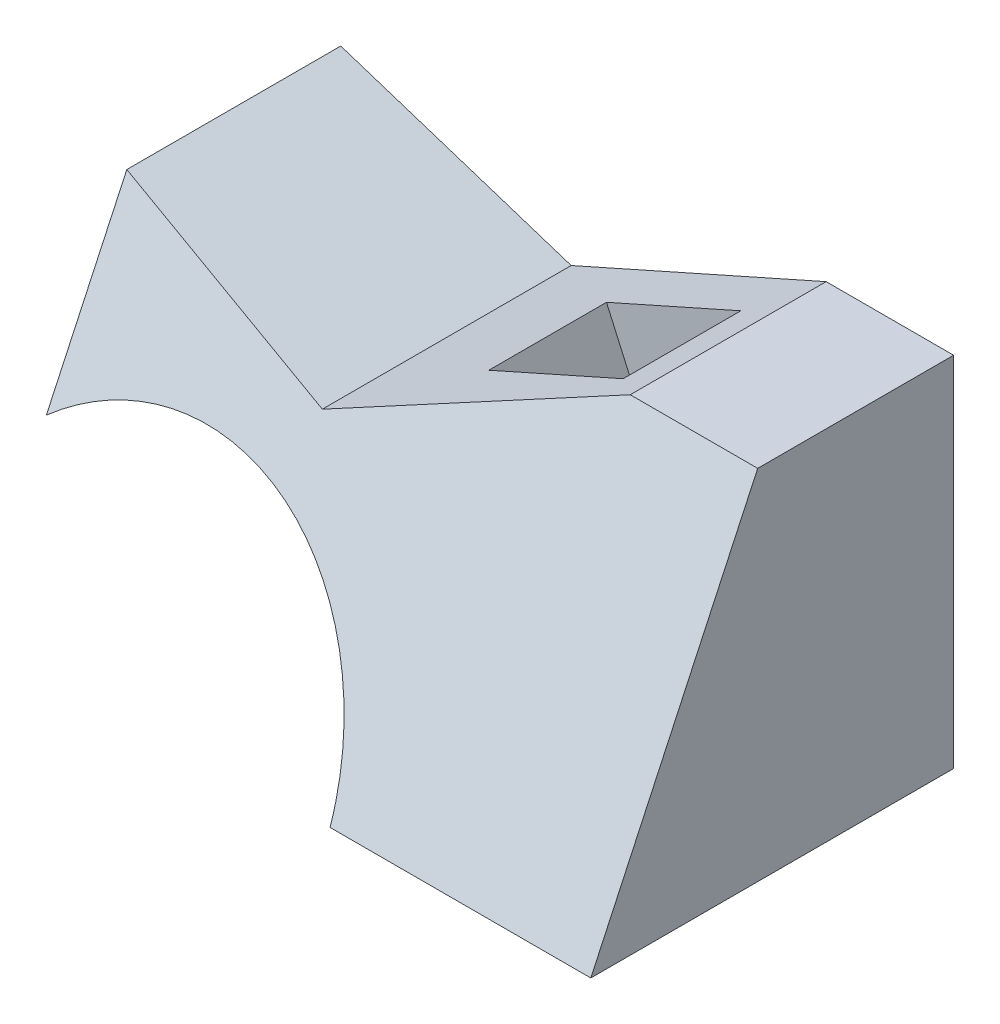
ISO-10303-21;
HEADER;
FILE_DESCRIPTION(('STEP AP214'),'2;1');
FILE_NAME('part.step','',(''),(''),'','','');
FILE_SCHEMA(('AUTOMOTIVE_DESIGN { 1 0 10303 214 1 1 1 1 }'));
ENDSEC;
DATA;
#1=APPLICATION_CONTEXT('core data for automotive mechanical design processes');
#2=APPLICATION_PROTOCOL_DEFINITION('international standard','automotive_design',2000,#1);
#3=PRODUCT_CONTEXT('',#1,'mechanical');
#4=PRODUCT('Part','Part','',(#3));
#5=PRODUCT_RELATED_PRODUCT_CATEGORY('part','',(#4));
#6=PRODUCT_DEFINITION_FORMATION('','',#4);
#7=PRODUCT_DEFINITION_CONTEXT('part definition',#1,'design');
#8=PRODUCT_DEFINITION('design','',#6,#7);
#9=PRODUCT_DEFINITION_SHAPE('','',#8);
#10=(LENGTH_UNIT() NAMED_UNIT(*) SI_UNIT(.MILLI.,.METRE.));
#11=(NAMED_UNIT(*) PLANE_ANGLE_UNIT() SI_UNIT($,.RADIAN.));
#12=(NAMED_UNIT(*) SI_UNIT($,.STERADIAN.) SOLID_ANGLE_UNIT());
#13=UNCERTAINTY_MEASURE_WITH_UNIT(LENGTH_MEASURE(1.E-05),#10,'distance_accuracy_value','');
#14=(GEOMETRIC_REPRESENTATION_CONTEXT(3) GLOBAL_UNCERTAINTY_ASSIGNED_CONTEXT((#13)) GLOBAL_UNIT_ASSIGNED_CONTEXT((#10,
#11,#12)) REPRESENTATION_CONTEXT('',''));
#15=CARTESIAN_POINT('',(0.,0.,0.));
#16=DIRECTION('',(0.,0.,1.));
#17=DIRECTION('',(1.,0.,0.));
#18=AXIS2_PLACEMENT_3D('',#15,#16,#17);
#19=CARTESIAN_POINT('',(0.,0.,74.));
#20=DIRECTION('',(-1.,0.,0.));
#21=DIRECTION('',(0.,0.,1.));
#22=AXIS2_PLACEMENT_3D('',#19,#20,#21);
#23=PLANE('',#22);
#24=DIRECTION('',(0.,0.,-1.));
#25=VECTOR('',#24,1.);
#26=CARTESIAN_POINT('',(0.,73.,74.));
#27=LINE('',#26,#25);
#28=CARTESIAN_POINT('',(0.,73.,39.9595409546853));
#29=VERTEX_POINT('',#28);
#30=CARTESIAN_POINT('',(0.,73.,0.));
#31=VERTEX_POINT('',#30);
#32=EDGE_CURVE('E11',#29,#31,#27,.T.);
#33=ORIENTED_EDGE('',*,*,#32,.F.);
#34=DIRECTION('',(0.,0.906307787036651,-0.422618261740697));
#35=VECTOR('',#34,1.);
#36=CARTESIAN_POINT('',(0.,0.,74.));
#37=LINE('',#36,#35);
#38=CARTESIAN_POINT('',(0.,0.,74.));
#39=VERTEX_POINT('',#38);
#40=EDGE_CURVE('E224',#39,#29,#37,.T.);
#41=ORIENTED_EDGE('',*,*,#40,.F.);
#42=DIRECTION('',(0.,0.,-1.));
#43=VECTOR('',#42,1.);
#44=CARTESIAN_POINT('',(0.,0.,74.));
#45=LINE('',#44,#43);
#46=CARTESIAN_POINT('',(0.,0.,0.));
#47=VERTEX_POINT('',#46);
#48=EDGE_CURVE('E106',#39,#47,#45,.T.);
#49=ORIENTED_EDGE('',*,*,#48,.T.);
#50=DIRECTION('',(0.,1.,0.));
#51=VECTOR('',#50,1.);
#52=CARTESIAN_POINT('',(0.,0.,0.));
#53=LINE('',#52,#51);
#54=EDGE_CURVE('E112',#47,#31,#53,.T.);
#55=ORIENTED_EDGE('',*,*,#54,.T.);
#56=EDGE_LOOP('',(#33,#41,#49,#55));
#57=FACE_BOUND('',#56,.T.);
#58=ADVANCED_FACE('F39',(#57),#23,.F.);
#59=CARTESIAN_POINT('',(0.,73.,74.));
#60=DIRECTION('',(0.,-1.,0.));
#61=DIRECTION('',(0.,0.,-1.));
#62=AXIS2_PLACEMENT_3D('',#59,#60,#61);
#63=PLANE('',#62);
#64=DIRECTION('',(0.,0.,-1.));
#65=VECTOR('',#64,1.);
#66=CARTESIAN_POINT('',(-26.,73.,74.));
#67=LINE('',#66,#65);
#68=CARTESIAN_POINT('',(-26.,73.,39.9595409546853));
#69=VERTEX_POINT('',#68);
#70=CARTESIAN_POINT('',(-26.,73.,0.));
#71=VERTEX_POINT('',#70);
#72=EDGE_CURVE('E46',#69,#71,#67,.T.);
#73=ORIENTED_EDGE('',*,*,#72,.F.);
#74=DIRECTION('',(1.,0.,0.));
#75=VECTOR('',#74,1.);
#76=CARTESIAN_POINT('',(-125.,73.,39.9595409546853));
#77=LINE('',#76,#75);
#78=EDGE_CURVE('E160',#69,#29,#77,.T.);
#79=ORIENTED_EDGE('',*,*,#78,.T.);
#80=ORIENTED_EDGE('',*,*,#32,.T.);
#81=DIRECTION('',(-1.,0.,0.));
#82=VECTOR('',#81,1.);
#83=CARTESIAN_POINT('',(0.,73.,0.));
#84=LINE('',#83,#82);
#85=EDGE_CURVE('E137',#31,#71,#84,.T.);
#86=ORIENTED_EDGE('',*,*,#85,.T.);
#87=EDGE_LOOP('',(#73,#79,#80,#86));
#88=FACE_BOUND('',#87,.T.);
#89=ADVANCED_FACE('F138',(#88),#63,.F.);
#90=CARTESIAN_POINT('',(-78.,49.8481083639562,74.));
#91=DIRECTION('',(0.406736643075799,-0.913545457642602,0.));
#92=DIRECTION('',(0.913545457642602,0.406736643075799,0.));
#93=AXIS2_PLACEMENT_3D('',#90,#91,#92);
#94=PLANE('',#93);
#95=DIRECTION('',(0.913545457642602,0.406736643075799,0.));
#96=VECTOR('',#95,1.);
#97=CARTESIAN_POINT('',(-32.3948182034982,70.1528434984695,35.));
#98=LINE('',#97,#96);
#99=CARTESIAN_POINT('',(-59.8011819327763,57.9507442061954,35.));
#100=VERTEX_POINT('',#99);
#101=CARTESIAN_POINT('',(-32.3948182034982,70.1528434984695,35.));
#102=VERTEX_POINT('',#101);
#103=EDGE_CURVE('E218',#100,#102,#98,.T.);
#104=ORIENTED_EDGE('',*,*,#103,.F.);
#105=DIRECTION('',(0.,0.,1.));
#106=VECTOR('',#105,1.);
#107=CARTESIAN_POINT('',(-59.8011819327763,57.9507442061955,35.));
#108=LINE('',#107,#106);
#109=CARTESIAN_POINT('',(-59.8011819327763,57.9507442061955,11.));
#110=VERTEX_POINT('',#109);
#111=EDGE_CURVE('E53',#110,#100,#108,.T.);
#112=ORIENTED_EDGE('',*,*,#111,.F.);
#113=DIRECTION('',(-0.913545457642602,-0.406736643075799,0.));
#114=VECTOR('',#113,1.);
#115=CARTESIAN_POINT('',(-32.3948182034982,70.1528434984695,11.));
#116=LINE('',#115,#114);
#117=CARTESIAN_POINT('',(-32.3948182034982,70.1528434984695,11.));
#118=VERTEX_POINT('',#117);
#119=EDGE_CURVE('E209',#118,#110,#116,.T.);
#120=ORIENTED_EDGE('',*,*,#119,.F.);
#121=DIRECTION('',(0.,0.,-1.));
#122=VECTOR('',#121,1.);
#123=CARTESIAN_POINT('',(-32.3948182034982,70.1528434984695,35.));
#124=LINE('',#123,#122);
#125=EDGE_CURVE('E212',#102,#118,#124,.T.);
#126=ORIENTED_EDGE('',*,*,#125,.F.);
#127=EDGE_LOOP('',(#104,#112,#120,#126));
#128=FACE_BOUND('',#127,.T.);
#129=DIRECTION('',(0.,0.,-1.));
#130=VECTOR('',#129,1.);
#131=CARTESIAN_POINT('',(-78.,49.8481083639562,74.));
#132=LINE('',#131,#130);
#133=CARTESIAN_POINT('',(-78.,49.8481083639562,50.7554453253471));
#134=VERTEX_POINT('',#133);
#135=CARTESIAN_POINT('',(-78.,49.8481083639562,0.));
#136=VERTEX_POINT('',#135);
#137=EDGE_CURVE('E121',#134,#136,#132,.T.);
#138=ORIENTED_EDGE('',*,*,#137,.F.);
#139=DIRECTION('',(0.897544583327985,0.399612594840915,-0.186342413269508));
#140=VECTOR('',#139,1.);
#141=CARTESIAN_POINT('',(-81.8876662663673,48.1172078232632,51.5625775029769));
#142=LINE('',#141,#140);
#143=EDGE_CURVE('E134',#134,#69,#142,.T.);
#144=ORIENTED_EDGE('',*,*,#143,.T.);
#145=ORIENTED_EDGE('',*,*,#72,.T.);
#146=DIRECTION('',(-0.913545457642602,-0.406736643075799,0.));
#147=VECTOR('',#146,1.);
#148=CARTESIAN_POINT('',(-78.,49.8481083639562,0.));
#149=LINE('',#148,#147);
#150=EDGE_CURVE('E130',#71,#136,#149,.T.);
#151=ORIENTED_EDGE('',*,*,#150,.T.);
#152=EDGE_LOOP('',(#138,#144,#145,#151));
#153=FACE_BOUND('',#152,.T.);
#154=ADVANCED_FACE('F128',(#128,#153),#94,.F.);
#155=CARTESIAN_POINT('',(-125.,65.119334086903,74.));
#156=DIRECTION('',(-0.309016994374951,-0.951056516295152,0.));
#157=DIRECTION('',(0.951056516295152,-0.309016994374951,0.));
#158=AXIS2_PLACEMENT_3D('',#155,#156,#157);
#159=PLANE('',#158);
#160=DIRECTION('',(0.,0.,-1.));
#161=VECTOR('',#160,1.);
#162=CARTESIAN_POINT('',(-125.,65.119334086903,74.));
#163=LINE('',#162,#161);
#164=CARTESIAN_POINT('',(-125.,65.119334086903,43.6343558213235));
#165=VERTEX_POINT('',#164);
#166=CARTESIAN_POINT('',(-125.,65.119334086903,0.));
#167=VERTEX_POINT('',#166);
#168=EDGE_CURVE('E119',#165,#167,#163,.T.);
#169=ORIENTED_EDGE('',*,*,#168,.F.);
#170=DIRECTION('',(0.941333826465117,-0.30585790094881,0.142623881519642));
#171=VECTOR('',#170,1.);
#172=CARTESIAN_POINT('',(-120.923209300911,63.79470449135,44.2520407459486));
#173=LINE('',#172,#171);
#174=EDGE_CURVE('E157',#165,#134,#173,.T.);
#175=ORIENTED_EDGE('',*,*,#174,.T.);
#176=ORIENTED_EDGE('',*,*,#137,.T.);
#177=DIRECTION('',(-0.951056516295152,0.309016994374951,0.));
#178=VECTOR('',#177,1.);
#179=CARTESIAN_POINT('',(-125.,65.119334086903,0.));
#180=LINE('',#179,#178);
#181=EDGE_CURVE('E142',#136,#167,#180,.T.);
#182=ORIENTED_EDGE('',*,*,#181,.T.);
#183=EDGE_LOOP('',(#169,#175,#176,#182));
#184=FACE_BOUND('',#183,.T.);
#185=ADVANCED_FACE('F155',(#184),#159,.F.);
#186=CARTESIAN_POINT('',(-125.,29.9411254969543,74.));
#187=DIRECTION('',(1.,0.,0.));
#188=DIRECTION('',(0.,0.,-1.));
#189=AXIS2_PLACEMENT_3D('',#186,#187,#188);
#190=PLANE('',#189);
#191=DIRECTION('',(0.,0.,-1.));
#192=VECTOR('',#191,1.);
#193=CARTESIAN_POINT('',(-125.,29.9411254969543,74.));
#194=LINE('',#193,#192);
#195=CARTESIAN_POINT('',(-125.,29.9411254969543,60.0382238869904));
#196=VERTEX_POINT('',#195);
#197=CARTESIAN_POINT('',(-125.,29.9411254969543,0.));
#198=VERTEX_POINT('',#197);
#199=EDGE_CURVE('E93',#196,#198,#194,.T.);
#200=ORIENTED_EDGE('',*,*,#199,.F.);
#201=DIRECTION('',(0.,0.906307787036651,-0.422618261740697));
#202=VECTOR('',#201,1.);
#203=CARTESIAN_POINT('',(-125.,0.,74.));
#204=LINE('',#203,#202);
#205=EDGE_CURVE('E152',#196,#165,#204,.T.);
#206=ORIENTED_EDGE('',*,*,#205,.T.);
#207=ORIENTED_EDGE('',*,*,#168,.T.);
#208=DIRECTION('',(0.,-1.,0.));
#209=VECTOR('',#208,1.);
#210=CARTESIAN_POINT('',(-125.,29.9411254969543,0.));
#211=LINE('',#210,#209);
#212=EDGE_CURVE('E99',#167,#198,#211,.T.);
#213=ORIENTED_EDGE('',*,*,#212,.T.);
#214=EDGE_LOOP('',(#200,#206,#207,#213));
#215=FACE_BOUND('',#214,.T.);
#216=ADVANCED_FACE('F147',(#215),#190,.F.);
#217=CARTESIAN_POINT('',(-97.,-4.00000000000001,74.));
#218=DIRECTION('',(0.,0.,-1.));
#219=DIRECTION('',(-1.,0.,0.));
#220=AXIS2_PLACEMENT_3D('',#217,#218,#219);
#221=CYLINDRICAL_SURFACE('',#220,44.);
#222=DIRECTION('',(0.,0.,-1.));
#223=VECTOR('',#222,1.);
#224=CARTESIAN_POINT('',(-53.1821953995867,0.,74.));
#225=LINE('',#224,#223);
#226=CARTESIAN_POINT('',(-53.1821953995867,0.,74.));
#227=VERTEX_POINT('',#226);
#228=CARTESIAN_POINT('',(-53.1821953995867,0.,0.));
#229=VERTEX_POINT('',#228);
#230=EDGE_CURVE('E90',#227,#229,#225,.T.);
#231=ORIENTED_EDGE('',*,*,#230,.F.);
#232=CARTESIAN_POINT('',(-97.,-4.00000000000001,75.86523063262));
#233=DIRECTION('',(0.,-0.422618261740697,-0.906307787036651));
#234=DIRECTION('',(0.,0.906307787036651,-0.422618261740697));
#235=AXIS2_PLACEMENT_3D('',#232,#233,#234);
#236=ELLIPSE('',#235,48.5486284343496,44.);
#237=EDGE_CURVE('E62',#227,#196,#236,.F.);
#238=ORIENTED_EDGE('',*,*,#237,.T.);
#239=ORIENTED_EDGE('',*,*,#199,.T.);
#240=CARTESIAN_POINT('',(-97.,-4.00000000000001,0.));
#241=DIRECTION('',(0.,0.,-1.));
#242=DIRECTION('',(1.,0.,0.));
#243=AXIS2_PLACEMENT_3D('',#240,#241,#242);
#244=CIRCLE('',#243,44.);
#245=EDGE_CURVE('E87',#198,#229,#244,.T.);
#246=ORIENTED_EDGE('',*,*,#245,.T.);
#247=EDGE_LOOP('',(#231,#238,#239,#246));
#248=FACE_BOUND('',#247,.T.);
#249=ADVANCED_FACE('F89',(#248),#221,.F.);
#250=CARTESIAN_POINT('',(0.,0.,74.));
#251=DIRECTION('',(0.,1.,0.));
#252=DIRECTION('',(0.,0.,1.));
#253=AXIS2_PLACEMENT_3D('',#250,#251,#252);
#254=PLANE('',#253);
#255=DIRECTION('',(1.,0.,0.));
#256=VECTOR('',#255,1.);
#257=CARTESIAN_POINT('',(0.,0.,0.));
#258=LINE('',#257,#256);
#259=EDGE_CURVE('E98',#229,#47,#258,.T.);
#260=ORIENTED_EDGE('',*,*,#259,.T.);
#261=ORIENTED_EDGE('',*,*,#48,.F.);
#262=DIRECTION('',(1.,0.,0.));
#263=VECTOR('',#262,1.);
#264=CARTESIAN_POINT('',(0.,0.,74.));
#265=LINE('',#264,#263);
#266=EDGE_CURVE('E105',#227,#39,#265,.T.);
#267=ORIENTED_EDGE('',*,*,#266,.F.);
#268=ORIENTED_EDGE('',*,*,#230,.T.);
#269=EDGE_LOOP('',(#260,#261,#267,#268));
#270=FACE_BOUND('',#269,.T.);
#271=ADVANCED_FACE('F102',(#270),#254,.F.);
#272=CARTESIAN_POINT('',(-97.,-4.00000000000001,0.));
#273=DIRECTION('',(0.,0.,1.));
#274=DIRECTION('',(1.,0.,0.));
#275=AXIS2_PLACEMENT_3D('',#272,#273,#274);
#276=PLANE('',#275);
#277=ORIENTED_EDGE('',*,*,#54,.F.);
#278=ORIENTED_EDGE('',*,*,#259,.F.);
#279=ORIENTED_EDGE('',*,*,#245,.F.);
#280=ORIENTED_EDGE('',*,*,#212,.F.);
#281=ORIENTED_EDGE('',*,*,#181,.F.);
#282=ORIENTED_EDGE('',*,*,#150,.F.);
#283=ORIENTED_EDGE('',*,*,#85,.F.);
#284=EDGE_LOOP('',(#277,#278,#279,#280,#281,#282,#283));
#285=FACE_BOUND('',#284,.T.);
#286=ADVANCED_FACE('F109',(#285),#276,.F.);
#287=CARTESIAN_POINT('',(-125.,0.,74.));
#288=DIRECTION('',(0.,-0.422618261740697,-0.906307787036651));
#289=DIRECTION('',(0.,0.906307787036651,-0.422618261740697));
#290=AXIS2_PLACEMENT_3D('',#287,#288,#289);
#291=PLANE('',#290);
#292=ORIENTED_EDGE('',*,*,#174,.F.);
#293=ORIENTED_EDGE('',*,*,#205,.F.);
#294=ORIENTED_EDGE('',*,*,#237,.F.);
#295=ORIENTED_EDGE('',*,*,#266,.T.);
#296=ORIENTED_EDGE('',*,*,#40,.T.);
#297=ORIENTED_EDGE('',*,*,#78,.F.);
#298=ORIENTED_EDGE('',*,*,#143,.F.);
#299=EDGE_LOOP('',(#292,#293,#294,#295,#296,#297,#298));
#300=FACE_BOUND('',#299,.T.);
#301=ADVANCED_FACE('F235',(#300),#291,.F.);
#302=CARTESIAN_POINT('',(-40.2778230651379,14.1005622393506,35.));
#303=DIRECTION('',(-0.913545457642602,-0.406736643075799,0.));
#304=DIRECTION('',(0.406736643075799,-0.913545457642602,0.));
#305=AXIS2_PLACEMENT_3D('',#302,#303,#304);
#306=PLANE('',#305);
#307=ORIENTED_EDGE('',*,*,#111,.T.);
#308=DIRECTION('',(-0.406736643075799,0.913545457642602,0.));
#309=VECTOR('',#308,1.);
#310=CARTESIAN_POINT('',(-40.2778230651379,14.1005622393506,35.));
#311=LINE('',#310,#309);
#312=CARTESIAN_POINT('',(-40.2778230651379,14.1005622393506,35.));
#313=VERTEX_POINT('',#312);
#314=EDGE_CURVE('E187',#313,#100,#311,.T.);
#315=ORIENTED_EDGE('',*,*,#314,.F.);
#316=DIRECTION('',(0.,0.,1.));
#317=VECTOR('',#316,1.);
#318=CARTESIAN_POINT('',(-40.2778230651379,14.1005622393506,35.));
#319=LINE('',#318,#317);
#320=CARTESIAN_POINT('',(-40.2778230651379,14.1005622393506,11.));
#321=VERTEX_POINT('',#320);
#322=EDGE_CURVE('E191',#321,#313,#319,.T.);
#323=ORIENTED_EDGE('',*,*,#322,.F.);
#324=DIRECTION('',(-0.406736643075799,0.913545457642602,0.));
#325=VECTOR('',#324,1.);
#326=CARTESIAN_POINT('',(-40.2778230651379,14.1005622393506,11.));
#327=LINE('',#326,#325);
#328=EDGE_CURVE('E222',#321,#110,#327,.T.);
#329=ORIENTED_EDGE('',*,*,#328,.T.);
#330=EDGE_LOOP('',(#307,#315,#323,#329));
#331=FACE_BOUND('',#330,.T.);
#332=ADVANCED_FACE('F189',(#331),#306,.F.);
#333=CARTESIAN_POINT('',(-12.8714593358599,26.3026615316246,11.));
#334=DIRECTION('',(0.,0.,-1.));
#335=DIRECTION('',(-1.,0.,0.));
#336=AXIS2_PLACEMENT_3D('',#333,#334,#335);
#337=PLANE('',#336);
#338=ORIENTED_EDGE('',*,*,#119,.T.);
#339=ORIENTED_EDGE('',*,*,#328,.F.);
#340=DIRECTION('',(-0.913545457642602,-0.406736643075799,0.));
#341=VECTOR('',#340,1.);
#342=CARTESIAN_POINT('',(-12.8714593358599,26.3026615316246,11.));
#343=LINE('',#342,#341);
#344=CARTESIAN_POINT('',(-12.8714593358599,26.3026615316246,11.));
#345=VERTEX_POINT('',#344);
#346=EDGE_CURVE('E197',#345,#321,#343,.T.);
#347=ORIENTED_EDGE('',*,*,#346,.F.);
#348=DIRECTION('',(-0.406736643075799,0.913545457642602,0.));
#349=VECTOR('',#348,1.);
#350=CARTESIAN_POINT('',(-12.8714593358599,26.3026615316246,11.));
#351=LINE('',#350,#349);
#352=EDGE_CURVE('E225',#345,#118,#351,.T.);
#353=ORIENTED_EDGE('',*,*,#352,.T.);
#354=EDGE_LOOP('',(#338,#339,#347,#353));
#355=FACE_BOUND('',#354,.T.);
#356=ADVANCED_FACE('F243',(#355),#337,.F.);
#357=CARTESIAN_POINT('',(-12.8714593358599,26.3026615316246,35.));
#358=DIRECTION('',(0.913545457642602,0.406736643075799,0.));
#359=DIRECTION('',(-0.406736643075799,0.913545457642602,0.));
#360=AXIS2_PLACEMENT_3D('',#357,#358,#359);
#361=PLANE('',#360);
#362=ORIENTED_EDGE('',*,*,#125,.T.);
#363=ORIENTED_EDGE('',*,*,#352,.F.);
#364=DIRECTION('',(0.,0.,-1.));
#365=VECTOR('',#364,1.);
#366=CARTESIAN_POINT('',(-12.8714593358599,26.3026615316246,35.));
#367=LINE('',#366,#365);
#368=CARTESIAN_POINT('',(-12.8714593358599,26.3026615316246,35.));
#369=VERTEX_POINT('',#368);
#370=EDGE_CURVE('E205',#369,#345,#367,.T.);
#371=ORIENTED_EDGE('',*,*,#370,.F.);
#372=DIRECTION('',(-0.406736643075799,0.913545457642602,0.));
#373=VECTOR('',#372,1.);
#374=CARTESIAN_POINT('',(-12.8714593358599,26.3026615316246,35.));
#375=LINE('',#374,#373);
#376=EDGE_CURVE('E196',#369,#102,#375,.T.);
#377=ORIENTED_EDGE('',*,*,#376,.T.);
#378=EDGE_LOOP('',(#362,#363,#371,#377));
#379=FACE_BOUND('',#378,.T.);
#380=ADVANCED_FACE('F307',(#379),#361,.F.);
#381=CARTESIAN_POINT('',(-12.8714593358599,26.3026615316246,35.));
#382=DIRECTION('',(0.,0.,1.));
#383=DIRECTION('',(1.,0.,0.));
#384=AXIS2_PLACEMENT_3D('',#381,#382,#383);
#385=PLANE('',#384);
#386=ORIENTED_EDGE('',*,*,#103,.T.);
#387=ORIENTED_EDGE('',*,*,#376,.F.);
#388=DIRECTION('',(0.913545457642602,0.406736643075799,0.));
#389=VECTOR('',#388,1.);
#390=CARTESIAN_POINT('',(-12.8714593358599,26.3026615316246,35.));
#391=LINE('',#390,#389);
#392=EDGE_CURVE('E200',#313,#369,#391,.T.);
#393=ORIENTED_EDGE('',*,*,#392,.F.);
#394=ORIENTED_EDGE('',*,*,#314,.T.);
#395=EDGE_LOOP('',(#386,#387,#393,#394));
#396=FACE_BOUND('',#395,.T.);
#397=ADVANCED_FACE('F201',(#396),#385,.F.);
#398=CARTESIAN_POINT('',(-11.9027293796213,26.7339678964597,0.));
#399=DIRECTION('',(-0.406736643075799,0.913545457642602,0.));
#400=DIRECTION('',(-0.913545457642602,-0.406736643075799,0.));
#401=AXIS2_PLACEMENT_3D('',#398,#399,#400);
#402=PLANE('',#401);
#403=ORIENTED_EDGE('',*,*,#322,.T.);
#404=ORIENTED_EDGE('',*,*,#392,.T.);
#405=ORIENTED_EDGE('',*,*,#370,.T.);
#406=ORIENTED_EDGE('',*,*,#346,.T.);
#407=EDGE_LOOP('',(#403,#404,#405,#406));
#408=FACE_BOUND('',#407,.T.);
#409=ADVANCED_FACE('F207',(#408),#402,.T.);
#410=CLOSED_SHELL('',(#58,#89,#154,#185,#216,#249,#271,#286,#301,#332,#356,#380,#397,#409));
#411=MANIFOLD_SOLID_BREP('B2',#410);
#412=ADVANCED_BREP_SHAPE_REPRESENTATION('',(#18,#411),#14);
#413=SHAPE_DEFINITION_REPRESENTATION(#9,#412);
ENDSEC;
END-ISO-10303-21;
